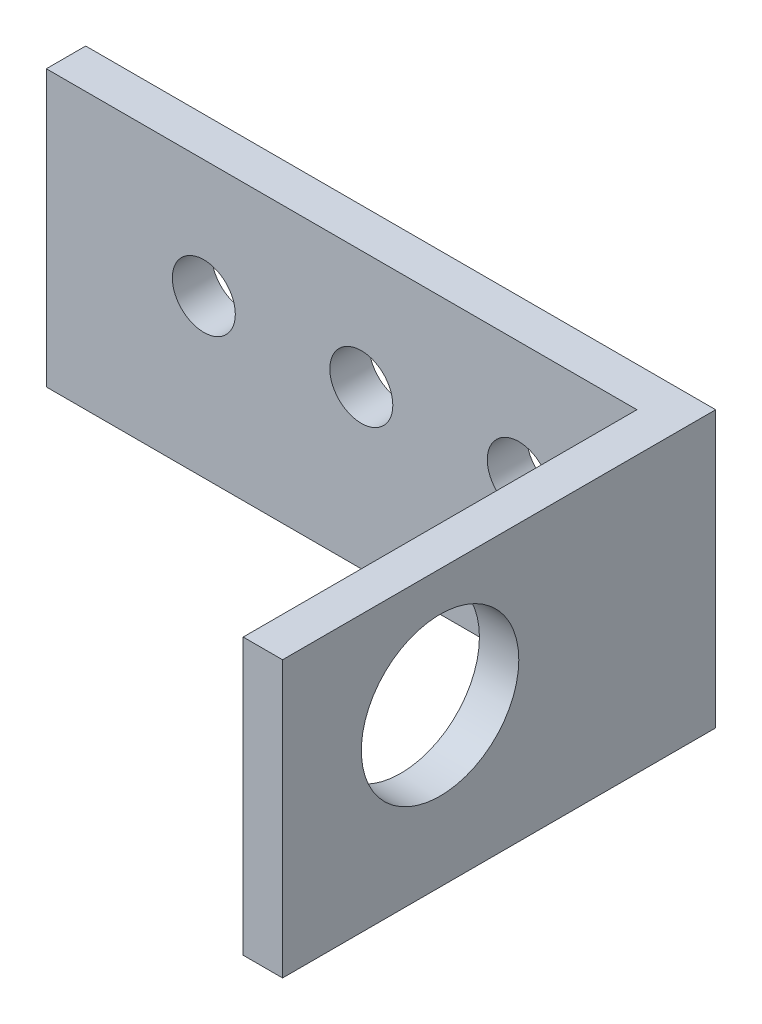
ISO-10303-21;
HEADER;
FILE_DESCRIPTION(('STEP AP214'),'2;1');
FILE_NAME('part.step','',(''),(''),'','','');
FILE_SCHEMA(('AUTOMOTIVE_DESIGN { 1 0 10303 214 1 1 1 1 }'));
ENDSEC;
DATA;
#1=APPLICATION_CONTEXT('core data for automotive mechanical design processes');
#2=APPLICATION_PROTOCOL_DEFINITION('international standard','automotive_design',2000,#1);
#3=PRODUCT_CONTEXT('',#1,'mechanical');
#4=PRODUCT('Part','Part','',(#3));
#5=PRODUCT_RELATED_PRODUCT_CATEGORY('part','',(#4));
#6=PRODUCT_DEFINITION_FORMATION('','',#4);
#7=PRODUCT_DEFINITION_CONTEXT('part definition',#1,'design');
#8=PRODUCT_DEFINITION('design','',#6,#7);
#9=PRODUCT_DEFINITION_SHAPE('','',#8);
#10=(LENGTH_UNIT() NAMED_UNIT(*) SI_UNIT(.MILLI.,.METRE.));
#11=(NAMED_UNIT(*) PLANE_ANGLE_UNIT() SI_UNIT($,.RADIAN.));
#12=(NAMED_UNIT(*) SI_UNIT($,.STERADIAN.) SOLID_ANGLE_UNIT());
#13=UNCERTAINTY_MEASURE_WITH_UNIT(LENGTH_MEASURE(1.E-05),#10,'distance_accuracy_value','');
#14=(GEOMETRIC_REPRESENTATION_CONTEXT(3) GLOBAL_UNCERTAINTY_ASSIGNED_CONTEXT((#13)) GLOBAL_UNIT_ASSIGNED_CONTEXT((#10,
#11,#12)) REPRESENTATION_CONTEXT('',''));
#15=CARTESIAN_POINT('',(0.,0.,0.));
#16=DIRECTION('',(0.,0.,1.));
#17=DIRECTION('',(1.,0.,0.));
#18=AXIS2_PLACEMENT_3D('',#15,#16,#17);
#19=CARTESIAN_POINT('',(22.225,22.225,0.));
#20=DIRECTION('',(-1.,0.,0.));
#21=DIRECTION('',(0.,0.,1.));
#22=AXIS2_PLACEMENT_3D('',#19,#20,#21);
#23=PLANE('',#22);
#24=CARTESIAN_POINT('',(22.225,12.7,4.7625));
#25=DIRECTION('',(-1.,0.,0.));
#26=DIRECTION('',(0.,0.,1.));
#27=AXIS2_PLACEMENT_3D('',#24,#25,#26);
#28=CIRCLE('',#27,6.35);
#29=CARTESIAN_POINT('',(22.225,12.7,11.1125));
#30=VERTEX_POINT('',#29);
#31=EDGE_CURVE('E134',#30,#30,#28,.F.);
#32=ORIENTED_EDGE('',*,*,#31,.T.);
#33=EDGE_LOOP('',(#32));
#34=FACE_BOUND('',#33,.T.);
#35=DIRECTION('',(0.,0.,-1.));
#36=VECTOR('',#35,1.);
#37=CARTESIAN_POINT('',(22.225,0.,0.));
#38=LINE('',#37,#36);
#39=CARTESIAN_POINT('',(22.225,0.,17.4625));
#40=VERTEX_POINT('',#39);
#41=CARTESIAN_POINT('',(22.225,0.,-14.2875));
#42=VERTEX_POINT('',#41);
#43=EDGE_CURVE('E129',#40,#42,#38,.T.);
#44=ORIENTED_EDGE('',*,*,#43,.F.);
#45=DIRECTION('',(0.,-1.,0.));
#46=VECTOR('',#45,1.);
#47=CARTESIAN_POINT('',(22.225,22.225,17.4625));
#48=LINE('',#47,#46);
#49=CARTESIAN_POINT('',(22.225,22.225,17.4625));
#50=VERTEX_POINT('',#49);
#51=EDGE_CURVE('E11',#50,#40,#48,.T.);
#52=ORIENTED_EDGE('',*,*,#51,.F.);
#53=DIRECTION('',(0.,0.,-1.));
#54=VECTOR('',#53,1.);
#55=CARTESIAN_POINT('',(22.225,22.225,0.));
#56=LINE('',#55,#54);
#57=CARTESIAN_POINT('',(22.225,22.225,-14.2875));
#58=VERTEX_POINT('',#57);
#59=EDGE_CURVE('E149',#50,#58,#56,.T.);
#60=ORIENTED_EDGE('',*,*,#59,.T.);
#61=DIRECTION('',(0.,-1.,0.));
#62=VECTOR('',#61,1.);
#63=CARTESIAN_POINT('',(22.225,22.225,-14.2875));
#64=LINE('',#63,#62);
#65=EDGE_CURVE('E88',#58,#42,#64,.T.);
#66=ORIENTED_EDGE('',*,*,#65,.T.);
#67=EDGE_LOOP('',(#44,#52,#60,#66));
#68=FACE_BOUND('',#67,.T.);
#69=ADVANCED_FACE('F43',(#34,#68),#23,.T.);
#70=CARTESIAN_POINT('',(0.,22.225,17.4625));
#71=DIRECTION('',(0.,0.,-1.));
#72=DIRECTION('',(-1.,0.,0.));
#73=AXIS2_PLACEMENT_3D('',#70,#71,#72);
#74=PLANE('',#73);
#75=DIRECTION('',(1.,0.,0.));
#76=VECTOR('',#75,1.);
#77=CARTESIAN_POINT('',(0.,0.,17.4625));
#78=LINE('',#77,#76);
#79=CARTESIAN_POINT('',(25.4,0.,17.4625));
#80=VERTEX_POINT('',#79);
#81=EDGE_CURVE('E133',#40,#80,#78,.T.);
#82=ORIENTED_EDGE('',*,*,#81,.T.);
#83=DIRECTION('',(0.,-1.,0.));
#84=VECTOR('',#83,1.);
#85=CARTESIAN_POINT('',(25.4,22.225,17.4625));
#86=LINE('',#85,#84);
#87=CARTESIAN_POINT('',(25.4,22.225,17.4625));
#88=VERTEX_POINT('',#87);
#89=EDGE_CURVE('E52',#88,#80,#86,.T.);
#90=ORIENTED_EDGE('',*,*,#89,.F.);
#91=DIRECTION('',(1.,0.,0.));
#92=VECTOR('',#91,1.);
#93=CARTESIAN_POINT('',(0.,22.225,17.4625));
#94=LINE('',#93,#92);
#95=EDGE_CURVE('E167',#50,#88,#94,.T.);
#96=ORIENTED_EDGE('',*,*,#95,.F.);
#97=ORIENTED_EDGE('',*,*,#51,.T.);
#98=EDGE_LOOP('',(#82,#90,#96,#97));
#99=FACE_BOUND('',#98,.T.);
#100=ADVANCED_FACE('F231',(#99),#74,.F.);
#101=CARTESIAN_POINT('',(25.4,22.225,0.));
#102=DIRECTION('',(-1.,0.,0.));
#103=DIRECTION('',(0.,0.,1.));
#104=AXIS2_PLACEMENT_3D('',#101,#102,#103);
#105=PLANE('',#104);
#106=CARTESIAN_POINT('',(25.4,12.7,4.7625));
#107=DIRECTION('',(1.,0.,0.));
#108=DIRECTION('',(0.,0.,-1.));
#109=AXIS2_PLACEMENT_3D('',#106,#107,#108);
#110=CIRCLE('',#109,6.35);
#111=CARTESIAN_POINT('',(25.4,12.7,-1.5875));
#112=VERTEX_POINT('',#111);
#113=EDGE_CURVE('E176',#112,#112,#110,.T.);
#114=ORIENTED_EDGE('',*,*,#113,.F.);
#115=EDGE_LOOP('',(#114));
#116=FACE_BOUND('',#115,.T.);
#117=DIRECTION('',(0.,0.,-1.));
#118=VECTOR('',#117,1.);
#119=CARTESIAN_POINT('',(25.4,0.,0.));
#120=LINE('',#119,#118);
#121=CARTESIAN_POINT('',(25.4,0.,-17.4625));
#122=VERTEX_POINT('',#121);
#123=EDGE_CURVE('E137',#80,#122,#120,.T.);
#124=ORIENTED_EDGE('',*,*,#123,.T.);
#125=DIRECTION('',(0.,-1.,0.));
#126=VECTOR('',#125,1.);
#127=CARTESIAN_POINT('',(25.4,22.225,-17.4625));
#128=LINE('',#127,#126);
#129=CARTESIAN_POINT('',(25.4,22.225,-17.4625));
#130=VERTEX_POINT('',#129);
#131=EDGE_CURVE('E113',#130,#122,#128,.T.);
#132=ORIENTED_EDGE('',*,*,#131,.F.);
#133=DIRECTION('',(0.,0.,-1.));
#134=VECTOR('',#133,1.);
#135=CARTESIAN_POINT('',(25.4,22.225,0.));
#136=LINE('',#135,#134);
#137=EDGE_CURVE('E118',#88,#130,#136,.T.);
#138=ORIENTED_EDGE('',*,*,#137,.F.);
#139=ORIENTED_EDGE('',*,*,#89,.T.);
#140=EDGE_LOOP('',(#124,#132,#138,#139));
#141=FACE_BOUND('',#140,.T.);
#142=ADVANCED_FACE('F160',(#116,#141),#105,.F.);
#143=CARTESIAN_POINT('',(0.,22.225,-17.4625));
#144=DIRECTION('',(0.,0.,-1.));
#145=DIRECTION('',(-1.,0.,0.));
#146=AXIS2_PLACEMENT_3D('',#143,#144,#145);
#147=PLANE('',#146);
#148=CARTESIAN_POINT('',(-12.7,12.7,-17.4625));
#149=DIRECTION('',(0.,0.,-1.));
#150=DIRECTION('',(-1.,0.,0.));
#151=AXIS2_PLACEMENT_3D('',#148,#149,#150);
#152=CIRCLE('',#151,2.54);
#153=CARTESIAN_POINT('',(-15.24,12.7,-17.4625));
#154=VERTEX_POINT('',#153);
#155=EDGE_CURVE('E180',#154,#154,#152,.F.);
#156=ORIENTED_EDGE('',*,*,#155,.T.);
#157=EDGE_LOOP('',(#156));
#158=FACE_BOUND('',#157,.T.);
#159=CARTESIAN_POINT('',(0.,12.7,-17.4625));
#160=DIRECTION('',(0.,0.,-1.));
#161=DIRECTION('',(-1.,0.,0.));
#162=AXIS2_PLACEMENT_3D('',#159,#160,#161);
#163=CIRCLE('',#162,2.54);
#164=CARTESIAN_POINT('',(-2.53999999999999,12.7,-17.4625));
#165=VERTEX_POINT('',#164);
#166=EDGE_CURVE('E190',#165,#165,#163,.F.);
#167=ORIENTED_EDGE('',*,*,#166,.T.);
#168=EDGE_LOOP('',(#167));
#169=FACE_BOUND('',#168,.T.);
#170=CARTESIAN_POINT('',(12.7,12.7,-17.4625));
#171=DIRECTION('',(0.,0.,-1.));
#172=DIRECTION('',(-1.,0.,0.));
#173=AXIS2_PLACEMENT_3D('',#170,#171,#172);
#174=CIRCLE('',#173,2.54);
#175=CARTESIAN_POINT('',(10.16,12.7,-17.4625));
#176=VERTEX_POINT('',#175);
#177=EDGE_CURVE('E181',#176,#176,#174,.F.);
#178=ORIENTED_EDGE('',*,*,#177,.T.);
#179=EDGE_LOOP('',(#178));
#180=FACE_BOUND('',#179,.T.);
#181=DIRECTION('',(1.,0.,0.));
#182=VECTOR('',#181,1.);
#183=CARTESIAN_POINT('',(0.,0.,-17.4625));
#184=LINE('',#183,#182);
#185=CARTESIAN_POINT('',(-25.4,0.,-17.4625));
#186=VERTEX_POINT('',#185);
#187=EDGE_CURVE('E107',#186,#122,#184,.T.);
#188=ORIENTED_EDGE('',*,*,#187,.F.);
#189=DIRECTION('',(0.,-1.,0.));
#190=VECTOR('',#189,1.);
#191=CARTESIAN_POINT('',(-25.4,22.225,-17.4625));
#192=LINE('',#191,#190);
#193=CARTESIAN_POINT('',(-25.4,22.225,-17.4625));
#194=VERTEX_POINT('',#193);
#195=EDGE_CURVE('E102',#194,#186,#192,.T.);
#196=ORIENTED_EDGE('',*,*,#195,.F.);
#197=DIRECTION('',(1.,0.,0.));
#198=VECTOR('',#197,1.);
#199=CARTESIAN_POINT('',(0.,22.225,-17.4625));
#200=LINE('',#199,#198);
#201=EDGE_CURVE('E105',#194,#130,#200,.T.);
#202=ORIENTED_EDGE('',*,*,#201,.T.);
#203=ORIENTED_EDGE('',*,*,#131,.T.);
#204=EDGE_LOOP('',(#188,#196,#202,#203));
#205=FACE_BOUND('',#204,.T.);
#206=ADVANCED_FACE('F104',(#158,#169,#180,#205),#147,.T.);
#207=CARTESIAN_POINT('',(-25.4,22.225,0.));
#208=DIRECTION('',(-1.,0.,0.));
#209=DIRECTION('',(0.,0.,1.));
#210=AXIS2_PLACEMENT_3D('',#207,#208,#209);
#211=PLANE('',#210);
#212=DIRECTION('',(0.,0.,-1.));
#213=VECTOR('',#212,1.);
#214=CARTESIAN_POINT('',(-25.4,0.,0.));
#215=LINE('',#214,#213);
#216=CARTESIAN_POINT('',(-25.4,0.,-14.2875));
#217=VERTEX_POINT('',#216);
#218=EDGE_CURVE('E143',#217,#186,#215,.T.);
#219=ORIENTED_EDGE('',*,*,#218,.F.);
#220=DIRECTION('',(0.,-1.,0.));
#221=VECTOR('',#220,1.);
#222=CARTESIAN_POINT('',(-25.4,22.225,-14.2875));
#223=LINE('',#222,#221);
#224=CARTESIAN_POINT('',(-25.4,22.225,-14.2875));
#225=VERTEX_POINT('',#224);
#226=EDGE_CURVE('E81',#225,#217,#223,.T.);
#227=ORIENTED_EDGE('',*,*,#226,.F.);
#228=DIRECTION('',(0.,0.,-1.));
#229=VECTOR('',#228,1.);
#230=CARTESIAN_POINT('',(-25.4,22.225,0.));
#231=LINE('',#230,#229);
#232=EDGE_CURVE('E116',#225,#194,#231,.T.);
#233=ORIENTED_EDGE('',*,*,#232,.T.);
#234=ORIENTED_EDGE('',*,*,#195,.T.);
#235=EDGE_LOOP('',(#219,#227,#233,#234));
#236=FACE_BOUND('',#235,.T.);
#237=ADVANCED_FACE('F122',(#236),#211,.T.);
#238=CARTESIAN_POINT('',(0.,22.225,-14.2875));
#239=DIRECTION('',(0.,0.,-1.));
#240=DIRECTION('',(-1.,0.,0.));
#241=AXIS2_PLACEMENT_3D('',#238,#239,#240);
#242=PLANE('',#241);
#243=CARTESIAN_POINT('',(-12.7,12.7,-14.2875));
#244=DIRECTION('',(0.,0.,1.));
#245=DIRECTION('',(1.,0.,0.));
#246=AXIS2_PLACEMENT_3D('',#243,#244,#245);
#247=CIRCLE('',#246,2.54);
#248=CARTESIAN_POINT('',(-10.16,12.7,-14.2875));
#249=VERTEX_POINT('',#248);
#250=EDGE_CURVE('E194',#249,#249,#247,.T.);
#251=ORIENTED_EDGE('',*,*,#250,.F.);
#252=EDGE_LOOP('',(#251));
#253=FACE_BOUND('',#252,.T.);
#254=CARTESIAN_POINT('',(0.,12.7,-14.2875));
#255=DIRECTION('',(0.,0.,1.));
#256=DIRECTION('',(1.,0.,0.));
#257=AXIS2_PLACEMENT_3D('',#254,#255,#256);
#258=CIRCLE('',#257,2.54);
#259=CARTESIAN_POINT('',(2.54000000000001,12.7,-14.2875));
#260=VERTEX_POINT('',#259);
#261=EDGE_CURVE('E185',#260,#260,#258,.T.);
#262=ORIENTED_EDGE('',*,*,#261,.F.);
#263=EDGE_LOOP('',(#262));
#264=FACE_BOUND('',#263,.T.);
#265=CARTESIAN_POINT('',(12.7,12.7,-14.2875));
#266=DIRECTION('',(0.,0.,1.));
#267=DIRECTION('',(1.,0.,0.));
#268=AXIS2_PLACEMENT_3D('',#265,#266,#267);
#269=CIRCLE('',#268,2.54);
#270=CARTESIAN_POINT('',(15.24,12.7,-14.2875));
#271=VERTEX_POINT('',#270);
#272=EDGE_CURVE('E186',#271,#271,#269,.T.);
#273=ORIENTED_EDGE('',*,*,#272,.F.);
#274=EDGE_LOOP('',(#273));
#275=FACE_BOUND('',#274,.T.);
#276=DIRECTION('',(1.,0.,0.));
#277=VECTOR('',#276,1.);
#278=CARTESIAN_POINT('',(0.,0.,-14.2875));
#279=LINE('',#278,#277);
#280=EDGE_CURVE('E146',#217,#42,#279,.T.);
#281=ORIENTED_EDGE('',*,*,#280,.T.);
#282=ORIENTED_EDGE('',*,*,#65,.F.);
#283=DIRECTION('',(1.,0.,0.));
#284=VECTOR('',#283,1.);
#285=CARTESIAN_POINT('',(0.,22.225,-14.2875));
#286=LINE('',#285,#284);
#287=EDGE_CURVE('E60',#225,#58,#286,.T.);
#288=ORIENTED_EDGE('',*,*,#287,.F.);
#289=ORIENTED_EDGE('',*,*,#226,.T.);
#290=EDGE_LOOP('',(#281,#282,#288,#289));
#291=FACE_BOUND('',#290,.T.);
#292=ADVANCED_FACE('F165',(#253,#264,#275,#291),#242,.F.);
#293=CARTESIAN_POINT('',(0.,22.225,0.));
#294=DIRECTION('',(0.,1.,0.));
#295=DIRECTION('',(0.,0.,1.));
#296=AXIS2_PLACEMENT_3D('',#293,#294,#295);
#297=PLANE('',#296);
#298=ORIENTED_EDGE('',*,*,#59,.F.);
#299=ORIENTED_EDGE('',*,*,#95,.T.);
#300=ORIENTED_EDGE('',*,*,#137,.T.);
#301=ORIENTED_EDGE('',*,*,#201,.F.);
#302=ORIENTED_EDGE('',*,*,#232,.F.);
#303=ORIENTED_EDGE('',*,*,#287,.T.);
#304=EDGE_LOOP('',(#298,#299,#300,#301,#302,#303));
#305=FACE_BOUND('',#304,.T.);
#306=ADVANCED_FACE('F115',(#305),#297,.T.);
#307=CARTESIAN_POINT('',(0.,0.,0.));
#308=DIRECTION('',(0.,1.,0.));
#309=DIRECTION('',(0.,0.,1.));
#310=AXIS2_PLACEMENT_3D('',#307,#308,#309);
#311=PLANE('',#310);
#312=ORIENTED_EDGE('',*,*,#43,.T.);
#313=ORIENTED_EDGE('',*,*,#280,.F.);
#314=ORIENTED_EDGE('',*,*,#218,.T.);
#315=ORIENTED_EDGE('',*,*,#187,.T.);
#316=ORIENTED_EDGE('',*,*,#123,.F.);
#317=ORIENTED_EDGE('',*,*,#81,.F.);
#318=EDGE_LOOP('',(#312,#313,#314,#315,#316,#317));
#319=FACE_BOUND('',#318,.T.);
#320=ADVANCED_FACE('F164',(#319),#311,.F.);
#321=CARTESIAN_POINT('',(4.2644877578617,12.7,4.7625));
#322=DIRECTION('',(1.,0.,0.));
#323=DIRECTION('',(0.,0.,-1.));
#324=AXIS2_PLACEMENT_3D('',#321,#322,#323);
#325=CYLINDRICAL_SURFACE('',#324,6.35);
#326=ORIENTED_EDGE('',*,*,#113,.T.);
#327=EDGE_LOOP('',(#326));
#328=FACE_BOUND('',#327,.T.);
#329=ORIENTED_EDGE('',*,*,#31,.F.);
#330=EDGE_LOOP('',(#329));
#331=FACE_BOUND('',#330,.T.);
#332=ADVANCED_FACE('F219',(#328,#331),#325,.F.);
#333=CARTESIAN_POINT('',(12.7,12.7,-24.6467048968553));
#334=DIRECTION('',(0.,0.,1.));
#335=DIRECTION('',(1.,0.,0.));
#336=AXIS2_PLACEMENT_3D('',#333,#334,#335);
#337=CYLINDRICAL_SURFACE('',#336,2.54);
#338=ORIENTED_EDGE('',*,*,#272,.T.);
#339=EDGE_LOOP('',(#338));
#340=FACE_BOUND('',#339,.T.);
#341=ORIENTED_EDGE('',*,*,#177,.F.);
#342=EDGE_LOOP('',(#341));
#343=FACE_BOUND('',#342,.T.);
#344=ADVANCED_FACE('F215',(#340,#343),#337,.F.);
#345=CARTESIAN_POINT('',(0.,12.7,-24.6467048968553));
#346=DIRECTION('',(0.,0.,1.));
#347=DIRECTION('',(1.,0.,0.));
#348=AXIS2_PLACEMENT_3D('',#345,#346,#347);
#349=CYLINDRICAL_SURFACE('',#348,2.54);
#350=ORIENTED_EDGE('',*,*,#261,.T.);
#351=EDGE_LOOP('',(#350));
#352=FACE_BOUND('',#351,.T.);
#353=ORIENTED_EDGE('',*,*,#166,.F.);
#354=EDGE_LOOP('',(#353));
#355=FACE_BOUND('',#354,.T.);
#356=ADVANCED_FACE('F218',(#352,#355),#349,.F.);
#357=CARTESIAN_POINT('',(-12.7,12.7,-24.6467048968553));
#358=DIRECTION('',(0.,0.,1.));
#359=DIRECTION('',(1.,0.,0.));
#360=AXIS2_PLACEMENT_3D('',#357,#358,#359);
#361=CYLINDRICAL_SURFACE('',#360,2.54);
#362=ORIENTED_EDGE('',*,*,#250,.T.);
#363=EDGE_LOOP('',(#362));
#364=FACE_BOUND('',#363,.T.);
#365=ORIENTED_EDGE('',*,*,#155,.F.);
#366=EDGE_LOOP('',(#365));
#367=FACE_BOUND('',#366,.T.);
#368=ADVANCED_FACE('F205',(#364,#367),#361,.F.);
#369=CLOSED_SHELL('',(#69,#100,#142,#206,#237,#292,#306,#320,#332,#344,#356,#368));
#370=MANIFOLD_SOLID_BREP('B2',#369);
#371=ADVANCED_BREP_SHAPE_REPRESENTATION('',(#18,#370),#14);
#372=SHAPE_DEFINITION_REPRESENTATION(#9,#371);
ENDSEC;
END-ISO-10303-21;
